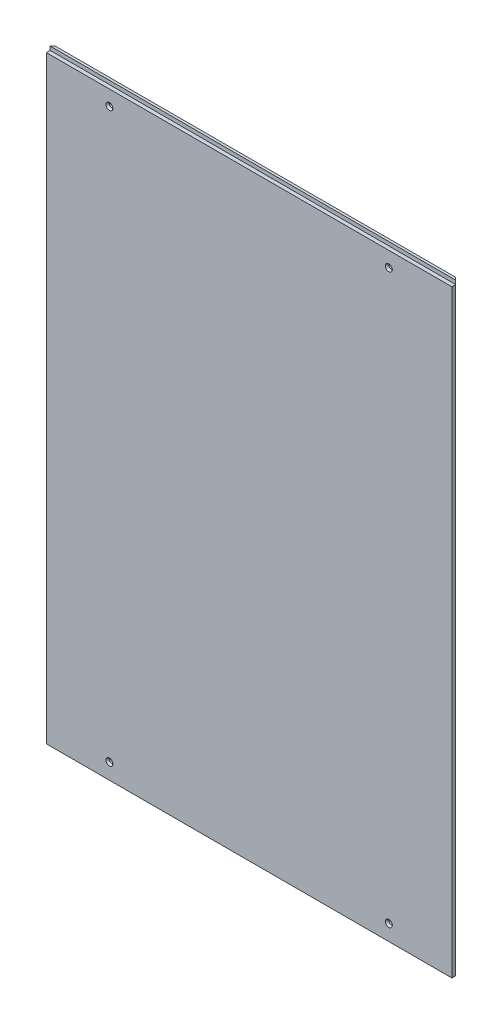
ISO-10303-21;
HEADER;
FILE_DESCRIPTION(('STEP AP214'),'2;1');
FILE_NAME('part.step','',(''),(''),'','','');
FILE_SCHEMA(('AUTOMOTIVE_DESIGN { 1 0 10303 214 1 1 1 1 }'));
ENDSEC;
DATA;
#1=APPLICATION_CONTEXT('core data for automotive mechanical design processes');
#2=APPLICATION_PROTOCOL_DEFINITION('international standard','automotive_design',2000,#1);
#3=PRODUCT_CONTEXT('',#1,'mechanical');
#4=PRODUCT('Part','Part','',(#3));
#5=PRODUCT_RELATED_PRODUCT_CATEGORY('part','',(#4));
#6=PRODUCT_DEFINITION_FORMATION('','',#4);
#7=PRODUCT_DEFINITION_CONTEXT('part definition',#1,'design');
#8=PRODUCT_DEFINITION('design','',#6,#7);
#9=PRODUCT_DEFINITION_SHAPE('','',#8);
#10=(LENGTH_UNIT() NAMED_UNIT(*) SI_UNIT(.MILLI.,.METRE.));
#11=(NAMED_UNIT(*) PLANE_ANGLE_UNIT() SI_UNIT($,.RADIAN.));
#12=(NAMED_UNIT(*) SI_UNIT($,.STERADIAN.) SOLID_ANGLE_UNIT());
#13=UNCERTAINTY_MEASURE_WITH_UNIT(LENGTH_MEASURE(1.E-05),#10,'distance_accuracy_value','');
#14=(GEOMETRIC_REPRESENTATION_CONTEXT(3) GLOBAL_UNCERTAINTY_ASSIGNED_CONTEXT((#13)) GLOBAL_UNIT_ASSIGNED_CONTEXT((#10,
#11,#12)) REPRESENTATION_CONTEXT('',''));
#15=CARTESIAN_POINT('',(0.,0.,0.));
#16=DIRECTION('',(0.,0.,1.));
#17=DIRECTION('',(1.,0.,0.));
#18=AXIS2_PLACEMENT_3D('',#15,#16,#17);
#19=CARTESIAN_POINT('',(321.5,-477.5,10.));
#20=DIRECTION('',(-1.,0.,0.));
#21=DIRECTION('',(0.,0.,1.));
#22=AXIS2_PLACEMENT_3D('',#19,#20,#21);
#23=PLANE('',#22);
#24=DIRECTION('',(0.,0.,-1.));
#25=VECTOR('',#24,1.);
#26=CARTESIAN_POINT('',(321.5,-477.5,10.));
#27=LINE('',#26,#25);
#28=CARTESIAN_POINT('',(321.5,-477.5,10.));
#29=VERTEX_POINT('',#28);
#30=CARTESIAN_POINT('',(321.5,-477.5,4.00000000000001));
#31=VERTEX_POINT('',#30);
#32=EDGE_CURVE('E193',#29,#31,#27,.T.);
#33=ORIENTED_EDGE('',*,*,#32,.T.);
#34=DIRECTION('',(0.,1.,0.));
#35=VECTOR('',#34,1.);
#36=CARTESIAN_POINT('',(321.5,477.5,4.));
#37=LINE('',#36,#35);
#38=CARTESIAN_POINT('',(321.5,471.5,4.));
#39=VERTEX_POINT('',#38);
#40=EDGE_CURVE('E124',#31,#39,#37,.T.);
#41=ORIENTED_EDGE('',*,*,#40,.T.);
#42=DIRECTION('',(0.,0.,1.));
#43=VECTOR('',#42,1.);
#44=CARTESIAN_POINT('',(321.5,471.5,10.));
#45=LINE('',#44,#43);
#46=CARTESIAN_POINT('',(321.5,471.5,10.));
#47=VERTEX_POINT('',#46);
#48=EDGE_CURVE('E109',#39,#47,#45,.T.);
#49=ORIENTED_EDGE('',*,*,#48,.T.);
#50=DIRECTION('',(0.,1.,0.));
#51=VECTOR('',#50,1.);
#52=CARTESIAN_POINT('',(321.5,-477.5,10.));
#53=LINE('',#52,#51);
#54=EDGE_CURVE('E175',#29,#47,#53,.T.);
#55=ORIENTED_EDGE('',*,*,#54,.F.);
#56=EDGE_LOOP('',(#33,#41,#49,#55));
#57=FACE_BOUND('',#56,.T.);
#58=ADVANCED_FACE('F34',(#57),#23,.F.);
#59=CARTESIAN_POINT('',(-321.5,477.5,10.));
#60=DIRECTION('',(0.,-1.,0.));
#61=DIRECTION('',(0.,0.,-1.));
#62=AXIS2_PLACEMENT_3D('',#59,#60,#61);
#63=PLANE('',#62);
#64=DIRECTION('',(-1.,0.,0.));
#65=VECTOR('',#64,1.);
#66=CARTESIAN_POINT('',(321.5,477.5,4.));
#67=LINE('',#66,#65);
#68=CARTESIAN_POINT('',(321.5,477.5,4.));
#69=VERTEX_POINT('',#68);
#70=CARTESIAN_POINT('',(-321.5,477.5,4.));
#71=VERTEX_POINT('',#70);
#72=EDGE_CURVE('E100',#69,#71,#67,.T.);
#73=ORIENTED_EDGE('',*,*,#72,.F.);
#74=DIRECTION('',(-0.707106781186548,0.,-0.707106781186548));
#75=VECTOR('',#74,1.);
#76=CARTESIAN_POINT('',(321.5,477.5,4.));
#77=LINE('',#76,#75);
#78=CARTESIAN_POINT('',(317.5,477.5,0.));
#79=VERTEX_POINT('',#78);
#80=EDGE_CURVE('E115',#69,#79,#77,.T.);
#81=ORIENTED_EDGE('',*,*,#80,.T.);
#82=DIRECTION('',(-1.,0.,0.));
#83=VECTOR('',#82,1.);
#84=CARTESIAN_POINT('',(-321.5,477.5,0.));
#85=LINE('',#84,#83);
#86=CARTESIAN_POINT('',(-317.5,477.5,0.));
#87=VERTEX_POINT('',#86);
#88=EDGE_CURVE('E188',#79,#87,#85,.T.);
#89=ORIENTED_EDGE('',*,*,#88,.T.);
#90=DIRECTION('',(-0.707106781186548,0.,0.707106781186548));
#91=VECTOR('',#90,1.);
#92=CARTESIAN_POINT('',(-321.5,477.5,4.));
#93=LINE('',#92,#91);
#94=EDGE_CURVE('E117',#87,#71,#93,.T.);
#95=ORIENTED_EDGE('',*,*,#94,.T.);
#96=EDGE_LOOP('',(#73,#81,#89,#95));
#97=FACE_BOUND('',#96,.T.);
#98=ADVANCED_FACE('F113',(#97),#63,.F.);
#99=CARTESIAN_POINT('',(-321.5,-477.5,10.));
#100=DIRECTION('',(1.,0.,0.));
#101=DIRECTION('',(0.,0.,-1.));
#102=AXIS2_PLACEMENT_3D('',#99,#100,#101);
#103=PLANE('',#102);
#104=DIRECTION('',(0.,0.,1.));
#105=VECTOR('',#104,1.);
#106=CARTESIAN_POINT('',(-321.5,471.5,10.));
#107=LINE('',#106,#105);
#108=CARTESIAN_POINT('',(-321.5,471.5,4.));
#109=VERTEX_POINT('',#108);
#110=CARTESIAN_POINT('',(-321.5,471.5,10.));
#111=VERTEX_POINT('',#110);
#112=EDGE_CURVE('E110',#109,#111,#107,.T.);
#113=ORIENTED_EDGE('',*,*,#112,.F.);
#114=DIRECTION('',(0.,-1.,0.));
#115=VECTOR('',#114,1.);
#116=CARTESIAN_POINT('',(-321.5,-477.5,4.));
#117=LINE('',#116,#115);
#118=CARTESIAN_POINT('',(-321.5,-477.5,4.00000000000001));
#119=VERTEX_POINT('',#118);
#120=EDGE_CURVE('E49',#109,#119,#117,.T.);
#121=ORIENTED_EDGE('',*,*,#120,.T.);
#122=DIRECTION('',(0.,0.,-1.));
#123=VECTOR('',#122,1.);
#124=CARTESIAN_POINT('',(-321.5,-477.5,10.));
#125=LINE('',#124,#123);
#126=CARTESIAN_POINT('',(-321.5,-477.5,10.));
#127=VERTEX_POINT('',#126);
#128=EDGE_CURVE('E196',#127,#119,#125,.T.);
#129=ORIENTED_EDGE('',*,*,#128,.F.);
#130=DIRECTION('',(0.,-1.,0.));
#131=VECTOR('',#130,1.);
#132=CARTESIAN_POINT('',(-321.5,-477.5,10.));
#133=LINE('',#132,#131);
#134=EDGE_CURVE('E184',#111,#127,#133,.T.);
#135=ORIENTED_EDGE('',*,*,#134,.F.);
#136=EDGE_LOOP('',(#113,#121,#129,#135));
#137=FACE_BOUND('',#136,.T.);
#138=ADVANCED_FACE('F213',(#137),#103,.F.);
#139=CARTESIAN_POINT('',(-321.5,-477.5,10.));
#140=DIRECTION('',(0.,1.,0.));
#141=DIRECTION('',(0.,0.,1.));
#142=AXIS2_PLACEMENT_3D('',#139,#140,#141);
#143=PLANE('',#142);
#144=DIRECTION('',(1.,0.,0.));
#145=VECTOR('',#144,1.);
#146=CARTESIAN_POINT('',(-321.5,-477.5,0.));
#147=LINE('',#146,#145);
#148=CARTESIAN_POINT('',(-317.5,-477.5,0.));
#149=VERTEX_POINT('',#148);
#150=CARTESIAN_POINT('',(317.5,-477.5,0.));
#151=VERTEX_POINT('',#150);
#152=EDGE_CURVE('E185',#149,#151,#147,.T.);
#153=ORIENTED_EDGE('',*,*,#152,.T.);
#154=DIRECTION('',(0.707106781186548,0.,0.707106781186548));
#155=VECTOR('',#154,1.);
#156=CARTESIAN_POINT('',(321.5,-477.5,4.));
#157=LINE('',#156,#155);
#158=EDGE_CURVE('E131',#151,#31,#157,.T.);
#159=ORIENTED_EDGE('',*,*,#158,.T.);
#160=ORIENTED_EDGE('',*,*,#32,.F.);
#161=DIRECTION('',(1.,0.,0.));
#162=VECTOR('',#161,1.);
#163=CARTESIAN_POINT('',(-321.5,-477.5,10.));
#164=LINE('',#163,#162);
#165=EDGE_CURVE('E179',#127,#29,#164,.T.);
#166=ORIENTED_EDGE('',*,*,#165,.F.);
#167=ORIENTED_EDGE('',*,*,#128,.T.);
#168=DIRECTION('',(0.707106781186548,0.,-0.707106781186548));
#169=VECTOR('',#168,1.);
#170=CARTESIAN_POINT('',(-321.5,-477.5,4.));
#171=LINE('',#170,#169);
#172=EDGE_CURVE('E129',#119,#149,#171,.T.);
#173=ORIENTED_EDGE('',*,*,#172,.T.);
#174=EDGE_LOOP('',(#153,#159,#160,#166,#167,#173));
#175=FACE_BOUND('',#174,.T.);
#176=ADVANCED_FACE('F167',(#175),#143,.F.);
#177=CARTESIAN_POINT('',(0.,0.,10.));
#178=DIRECTION('',(0.,0.,-1.));
#179=DIRECTION('',(-1.,0.,0.));
#180=AXIS2_PLACEMENT_3D('',#177,#178,#179);
#181=PLANE('',#180);
#182=CARTESIAN_POINT('',(-221.5,-452.5,10.));
#183=DIRECTION('',(0.,0.,-1.));
#184=DIRECTION('',(-1.,0.,0.));
#185=AXIS2_PLACEMENT_3D('',#182,#183,#184);
#186=CIRCLE('',#185,5.50000000000017);
#187=CARTESIAN_POINT('',(-227.,-452.5,10.));
#188=VERTEX_POINT('',#187);
#189=EDGE_CURVE('E143',#188,#188,#186,.T.);
#190=ORIENTED_EDGE('',*,*,#189,.T.);
#191=EDGE_LOOP('',(#190));
#192=FACE_BOUND('',#191,.T.);
#193=CARTESIAN_POINT('',(221.5,-452.5,10.));
#194=DIRECTION('',(0.,0.,-1.));
#195=DIRECTION('',(-1.,0.,0.));
#196=AXIS2_PLACEMENT_3D('',#193,#194,#195);
#197=CIRCLE('',#196,5.50000000000017);
#198=CARTESIAN_POINT('',(216.,-452.5,10.));
#199=VERTEX_POINT('',#198);
#200=EDGE_CURVE('E140',#199,#199,#197,.T.);
#201=ORIENTED_EDGE('',*,*,#200,.T.);
#202=EDGE_LOOP('',(#201));
#203=FACE_BOUND('',#202,.T.);
#204=CARTESIAN_POINT('',(221.5,447.5,10.));
#205=DIRECTION('',(0.,0.,-1.));
#206=DIRECTION('',(-1.,0.,0.));
#207=AXIS2_PLACEMENT_3D('',#204,#205,#206);
#208=CIRCLE('',#207,5.50000000000017);
#209=CARTESIAN_POINT('',(216.,447.5,10.));
#210=VERTEX_POINT('',#209);
#211=EDGE_CURVE('E137',#210,#210,#208,.T.);
#212=ORIENTED_EDGE('',*,*,#211,.T.);
#213=EDGE_LOOP('',(#212));
#214=FACE_BOUND('',#213,.T.);
#215=CARTESIAN_POINT('',(-221.5,447.5,10.));
#216=DIRECTION('',(0.,0.,-1.));
#217=DIRECTION('',(-1.,0.,0.));
#218=AXIS2_PLACEMENT_3D('',#215,#216,#217);
#219=CIRCLE('',#218,5.50000000000017);
#220=CARTESIAN_POINT('',(-227.,447.5,10.));
#221=VERTEX_POINT('',#220);
#222=EDGE_CURVE('E134',#221,#221,#219,.T.);
#223=ORIENTED_EDGE('',*,*,#222,.T.);
#224=EDGE_LOOP('',(#223));
#225=FACE_BOUND('',#224,.T.);
#226=ORIENTED_EDGE('',*,*,#54,.T.);
#227=DIRECTION('',(-1.,0.,0.));
#228=VECTOR('',#227,1.);
#229=CARTESIAN_POINT('',(321.5,471.5,10.));
#230=LINE('',#229,#228);
#231=EDGE_CURVE('E176',#47,#111,#230,.T.);
#232=ORIENTED_EDGE('',*,*,#231,.T.);
#233=ORIENTED_EDGE('',*,*,#134,.T.);
#234=ORIENTED_EDGE('',*,*,#165,.T.);
#235=EDGE_LOOP('',(#226,#232,#233,#234));
#236=FACE_BOUND('',#235,.T.);
#237=ADVANCED_FACE('F163',(#192,#203,#214,#225,#236),#181,.F.);
#238=CARTESIAN_POINT('',(0.,0.,0.));
#239=DIRECTION('',(0.,0.,-1.));
#240=DIRECTION('',(-1.,0.,0.));
#241=AXIS2_PLACEMENT_3D('',#238,#239,#240);
#242=PLANE('',#241);
#243=CARTESIAN_POINT('',(-241.5,447.5,0.));
#244=DIRECTION('',(0.,0.,-1.));
#245=DIRECTION('',(-1.,0.,0.));
#246=AXIS2_PLACEMENT_3D('',#243,#244,#245);
#247=CIRCLE('',#246,5.99999999999999);
#248=CARTESIAN_POINT('',(-247.5,447.5,0.));
#249=VERTEX_POINT('',#248);
#250=EDGE_CURVE('E309',#249,#249,#247,.T.);
#251=ORIENTED_EDGE('',*,*,#250,.F.);
#252=EDGE_LOOP('',(#251));
#253=FACE_BOUND('',#252,.T.);
#254=CARTESIAN_POINT('',(-201.5,447.5,0.));
#255=DIRECTION('',(0.,0.,-1.));
#256=DIRECTION('',(-1.,0.,0.));
#257=AXIS2_PLACEMENT_3D('',#254,#255,#256);
#258=CIRCLE('',#257,5.99999999999999);
#259=CARTESIAN_POINT('',(-207.5,447.5,0.));
#260=VERTEX_POINT('',#259);
#261=EDGE_CURVE('E308',#260,#260,#258,.T.);
#262=ORIENTED_EDGE('',*,*,#261,.F.);
#263=EDGE_LOOP('',(#262));
#264=FACE_BOUND('',#263,.T.);
#265=CARTESIAN_POINT('',(201.5,447.5,0.));
#266=DIRECTION('',(0.,0.,-1.));
#267=DIRECTION('',(-1.,0.,0.));
#268=AXIS2_PLACEMENT_3D('',#265,#266,#267);
#269=CIRCLE('',#268,5.99999999999999);
#270=CARTESIAN_POINT('',(195.5,447.5,0.));
#271=VERTEX_POINT('',#270);
#272=EDGE_CURVE('E318',#271,#271,#269,.T.);
#273=ORIENTED_EDGE('',*,*,#272,.F.);
#274=EDGE_LOOP('',(#273));
#275=FACE_BOUND('',#274,.T.);
#276=CARTESIAN_POINT('',(241.5,447.5,0.));
#277=DIRECTION('',(0.,0.,-1.));
#278=DIRECTION('',(-1.,0.,0.));
#279=AXIS2_PLACEMENT_3D('',#276,#277,#278);
#280=CIRCLE('',#279,5.99999999999999);
#281=CARTESIAN_POINT('',(235.5,447.5,0.));
#282=VERTEX_POINT('',#281);
#283=EDGE_CURVE('E323',#282,#282,#280,.T.);
#284=ORIENTED_EDGE('',*,*,#283,.F.);
#285=EDGE_LOOP('',(#284));
#286=FACE_BOUND('',#285,.T.);
#287=CARTESIAN_POINT('',(221.5,447.5,0.));
#288=DIRECTION('',(0.,0.,-1.));
#289=DIRECTION('',(-1.,0.,0.));
#290=AXIS2_PLACEMENT_3D('',#287,#288,#289);
#291=CIRCLE('',#290,2.60000000000001);
#292=CARTESIAN_POINT('',(218.9,447.5,0.));
#293=VERTEX_POINT('',#292);
#294=EDGE_CURVE('E329',#293,#293,#291,.T.);
#295=ORIENTED_EDGE('',*,*,#294,.F.);
#296=EDGE_LOOP('',(#295));
#297=FACE_BOUND('',#296,.T.);
#298=CARTESIAN_POINT('',(-221.5,447.5,0.));
#299=DIRECTION('',(0.,0.,-1.));
#300=DIRECTION('',(-1.,0.,0.));
#301=AXIS2_PLACEMENT_3D('',#298,#299,#300);
#302=CIRCLE('',#301,2.60000000000008);
#303=CARTESIAN_POINT('',(-224.1,447.5,0.));
#304=VERTEX_POINT('',#303);
#305=EDGE_CURVE('E334',#304,#304,#302,.T.);
#306=ORIENTED_EDGE('',*,*,#305,.F.);
#307=EDGE_LOOP('',(#306));
#308=FACE_BOUND('',#307,.T.);
#309=CARTESIAN_POINT('',(-221.5,-452.5,0.));
#310=DIRECTION('',(0.,0.,-1.));
#311=DIRECTION('',(-1.,0.,0.));
#312=AXIS2_PLACEMENT_3D('',#309,#310,#311);
#313=CIRCLE('',#312,2.60000000000008);
#314=CARTESIAN_POINT('',(-224.1,-452.5,0.));
#315=VERTEX_POINT('',#314);
#316=EDGE_CURVE('E207',#315,#315,#313,.T.);
#317=ORIENTED_EDGE('',*,*,#316,.F.);
#318=EDGE_LOOP('',(#317));
#319=FACE_BOUND('',#318,.T.);
#320=CARTESIAN_POINT('',(221.5,-452.5,0.));
#321=DIRECTION('',(0.,0.,-1.));
#322=DIRECTION('',(-1.,0.,0.));
#323=AXIS2_PLACEMENT_3D('',#320,#321,#322);
#324=CIRCLE('',#323,2.60000000000001);
#325=CARTESIAN_POINT('',(218.9,-452.5,0.));
#326=VERTEX_POINT('',#325);
#327=EDGE_CURVE('E203',#326,#326,#324,.T.);
#328=ORIENTED_EDGE('',*,*,#327,.F.);
#329=EDGE_LOOP('',(#328));
#330=FACE_BOUND('',#329,.T.);
#331=ORIENTED_EDGE('',*,*,#88,.F.);
#332=DIRECTION('',(0.,-1.,0.));
#333=VECTOR('',#332,1.);
#334=CARTESIAN_POINT('',(317.5,-477.5,0.));
#335=LINE('',#334,#333);
#336=EDGE_CURVE('E57',#79,#151,#335,.T.);
#337=ORIENTED_EDGE('',*,*,#336,.T.);
#338=ORIENTED_EDGE('',*,*,#152,.F.);
#339=DIRECTION('',(0.,1.,0.));
#340=VECTOR('',#339,1.);
#341=CARTESIAN_POINT('',(-317.5,477.5,0.));
#342=LINE('',#341,#340);
#343=EDGE_CURVE('E121',#149,#87,#342,.T.);
#344=ORIENTED_EDGE('',*,*,#343,.T.);
#345=EDGE_LOOP('',(#331,#337,#338,#344));
#346=FACE_BOUND('',#345,.T.);
#347=ADVANCED_FACE('F166',(#253,#264,#275,#286,#297,#308,#319,#330,#346),#242,.T.);
#348=CARTESIAN_POINT('',(321.5,471.5,10.));
#349=DIRECTION('',(0.,-1.,0.));
#350=DIRECTION('',(0.,0.,-1.));
#351=AXIS2_PLACEMENT_3D('',#348,#349,#350);
#352=PLANE('',#351);
#353=ORIENTED_EDGE('',*,*,#112,.T.);
#354=ORIENTED_EDGE('',*,*,#231,.F.);
#355=ORIENTED_EDGE('',*,*,#48,.F.);
#356=DIRECTION('',(-1.,0.,0.));
#357=VECTOR('',#356,1.);
#358=CARTESIAN_POINT('',(321.5,471.5,4.));
#359=LINE('',#358,#357);
#360=EDGE_CURVE('E103',#39,#109,#359,.T.);
#361=ORIENTED_EDGE('',*,*,#360,.T.);
#362=EDGE_LOOP('',(#353,#354,#355,#361));
#363=FACE_BOUND('',#362,.T.);
#364=ADVANCED_FACE('F212',(#363),#352,.F.);
#365=CARTESIAN_POINT('',(321.5,477.5,4.));
#366=DIRECTION('',(0.,0.,-1.));
#367=DIRECTION('',(0.,1.,0.));
#368=AXIS2_PLACEMENT_3D('',#365,#366,#367);
#369=PLANE('',#368);
#370=DIRECTION('',(0.,-1.,0.));
#371=VECTOR('',#370,1.);
#372=CARTESIAN_POINT('',(-321.5,477.5,4.));
#373=LINE('',#372,#371);
#374=EDGE_CURVE('E202',#71,#109,#373,.T.);
#375=ORIENTED_EDGE('',*,*,#374,.T.);
#376=ORIENTED_EDGE('',*,*,#360,.F.);
#377=DIRECTION('',(0.,-1.,0.));
#378=VECTOR('',#377,1.);
#379=CARTESIAN_POINT('',(321.5,477.5,4.));
#380=LINE('',#379,#378);
#381=EDGE_CURVE('E96',#69,#39,#380,.T.);
#382=ORIENTED_EDGE('',*,*,#381,.F.);
#383=ORIENTED_EDGE('',*,*,#72,.T.);
#384=EDGE_LOOP('',(#375,#376,#382,#383));
#385=FACE_BOUND('',#384,.T.);
#386=ADVANCED_FACE('F99',(#385),#369,.F.);
#387=CARTESIAN_POINT('',(321.5,-477.5,4.));
#388=DIRECTION('',(0.707106781186547,0.,-0.707106781186547));
#389=DIRECTION('',(0.,-1.,0.));
#390=AXIS2_PLACEMENT_3D('',#387,#388,#389);
#391=PLANE('',#390);
#392=ORIENTED_EDGE('',*,*,#158,.F.);
#393=ORIENTED_EDGE('',*,*,#336,.F.);
#394=ORIENTED_EDGE('',*,*,#80,.F.);
#395=ORIENTED_EDGE('',*,*,#381,.T.);
#396=ORIENTED_EDGE('',*,*,#40,.F.);
#397=EDGE_LOOP('',(#392,#393,#394,#395,#396));
#398=FACE_BOUND('',#397,.T.);
#399=ADVANCED_FACE('F120',(#398),#391,.T.);
#400=CARTESIAN_POINT('',(-321.5,-477.5,4.));
#401=DIRECTION('',(-0.707106781186547,0.,-0.707106781186547));
#402=DIRECTION('',(0.,1.,0.));
#403=AXIS2_PLACEMENT_3D('',#400,#401,#402);
#404=PLANE('',#403);
#405=ORIENTED_EDGE('',*,*,#94,.F.);
#406=ORIENTED_EDGE('',*,*,#343,.F.);
#407=ORIENTED_EDGE('',*,*,#172,.F.);
#408=ORIENTED_EDGE('',*,*,#120,.F.);
#409=ORIENTED_EDGE('',*,*,#374,.F.);
#410=EDGE_LOOP('',(#405,#406,#407,#408,#409));
#411=FACE_BOUND('',#410,.T.);
#412=ADVANCED_FACE('F201',(#411),#404,.T.);
#413=CARTESIAN_POINT('',(221.5,-452.5,10.));
#414=DIRECTION('',(0.,0.,-1.));
#415=DIRECTION('',(-1.,0.,0.));
#416=AXIS2_PLACEMENT_3D('',#413,#414,#415);
#417=CYLINDRICAL_SURFACE('',#416,2.60000000000001);
#418=CARTESIAN_POINT('',(221.5,-452.5,7.09999999999983));
#419=DIRECTION('',(0.,0.,-1.));
#420=DIRECTION('',(-1.,0.,0.));
#421=AXIS2_PLACEMENT_3D('',#418,#419,#420);
#422=CIRCLE('',#421,2.60000000000001);
#423=CARTESIAN_POINT('',(218.9,-452.5,7.09999999999983));
#424=VERTEX_POINT('',#423);
#425=EDGE_CURVE('E149',#424,#424,#422,.F.);
#426=ORIENTED_EDGE('',*,*,#425,.T.);
#427=EDGE_LOOP('',(#426));
#428=FACE_BOUND('',#427,.T.);
#429=ORIENTED_EDGE('',*,*,#327,.T.);
#430=EDGE_LOOP('',(#429));
#431=FACE_BOUND('',#430,.T.);
#432=ADVANCED_FACE('F231',(#428,#431),#417,.F.);
#433=CARTESIAN_POINT('',(-221.5,-452.5,10.));
#434=DIRECTION('',(0.,0.,-1.));
#435=DIRECTION('',(-1.,0.,0.));
#436=AXIS2_PLACEMENT_3D('',#433,#434,#435);
#437=CYLINDRICAL_SURFACE('',#436,2.60000000000008);
#438=CARTESIAN_POINT('',(-221.5,-452.5,7.0999999999999));
#439=DIRECTION('',(0.,0.,-1.));
#440=DIRECTION('',(-1.,0.,0.));
#441=AXIS2_PLACEMENT_3D('',#438,#439,#440);
#442=CIRCLE('',#441,2.60000000000008);
#443=CARTESIAN_POINT('',(-224.1,-452.5,7.0999999999999));
#444=VERTEX_POINT('',#443);
#445=EDGE_CURVE('E146',#444,#444,#442,.F.);
#446=ORIENTED_EDGE('',*,*,#445,.T.);
#447=EDGE_LOOP('',(#446));
#448=FACE_BOUND('',#447,.T.);
#449=ORIENTED_EDGE('',*,*,#316,.T.);
#450=EDGE_LOOP('',(#449));
#451=FACE_BOUND('',#450,.T.);
#452=ADVANCED_FACE('F247',(#448,#451),#437,.F.);
#453=CARTESIAN_POINT('',(-221.5,447.5,10.));
#454=DIRECTION('',(0.,0.,-1.));
#455=DIRECTION('',(-1.,0.,0.));
#456=AXIS2_PLACEMENT_3D('',#453,#454,#455);
#457=CYLINDRICAL_SURFACE('',#456,2.60000000000008);
#458=CARTESIAN_POINT('',(-221.5,447.5,7.0999999999999));
#459=DIRECTION('',(0.,0.,-1.));
#460=DIRECTION('',(-1.,0.,0.));
#461=AXIS2_PLACEMENT_3D('',#458,#459,#460);
#462=CIRCLE('',#461,2.60000000000008);
#463=CARTESIAN_POINT('',(-224.1,447.5,7.0999999999999));
#464=VERTEX_POINT('',#463);
#465=EDGE_CURVE('E11',#464,#464,#462,.F.);
#466=ORIENTED_EDGE('',*,*,#465,.T.);
#467=EDGE_LOOP('',(#466));
#468=FACE_BOUND('',#467,.T.);
#469=ORIENTED_EDGE('',*,*,#305,.T.);
#470=EDGE_LOOP('',(#469));
#471=FACE_BOUND('',#470,.T.);
#472=ADVANCED_FACE('F265',(#468,#471),#457,.F.);
#473=CARTESIAN_POINT('',(221.5,447.5,10.));
#474=DIRECTION('',(0.,0.,-1.));
#475=DIRECTION('',(-1.,0.,0.));
#476=AXIS2_PLACEMENT_3D('',#473,#474,#475);
#477=CYLINDRICAL_SURFACE('',#476,2.60000000000001);
#478=CARTESIAN_POINT('',(221.5,447.5,7.09999999999983));
#479=DIRECTION('',(0.,0.,-1.));
#480=DIRECTION('',(-1.,0.,0.));
#481=AXIS2_PLACEMENT_3D('',#478,#479,#480);
#482=CIRCLE('',#481,2.60000000000001);
#483=CARTESIAN_POINT('',(218.9,447.5,7.09999999999983));
#484=VERTEX_POINT('',#483);
#485=EDGE_CURVE('E42',#484,#484,#482,.F.);
#486=ORIENTED_EDGE('',*,*,#485,.T.);
#487=EDGE_LOOP('',(#486));
#488=FACE_BOUND('',#487,.T.);
#489=ORIENTED_EDGE('',*,*,#294,.T.);
#490=EDGE_LOOP('',(#489));
#491=FACE_BOUND('',#490,.T.);
#492=ADVANCED_FACE('F154',(#488,#491),#477,.F.);
#493=CARTESIAN_POINT('',(-221.5,-452.5,10.));
#494=DIRECTION('',(0.,0.,1.));
#495=DIRECTION('',(1.,0.,0.));
#496=AXIS2_PLACEMENT_3D('',#493,#494,#495);
#497=CONICAL_SURFACE('',#496,5.50000000000017,0.785398163397447);
#498=ORIENTED_EDGE('',*,*,#445,.F.);
#499=EDGE_LOOP('',(#498));
#500=FACE_BOUND('',#499,.T.);
#501=ORIENTED_EDGE('',*,*,#189,.F.);
#502=EDGE_LOOP('',(#501));
#503=FACE_BOUND('',#502,.T.);
#504=ADVANCED_FACE('F232',(#500,#503),#497,.F.);
#505=CARTESIAN_POINT('',(221.5,-452.5,10.));
#506=DIRECTION('',(0.,0.,1.));
#507=DIRECTION('',(1.,0.,0.));
#508=AXIS2_PLACEMENT_3D('',#505,#506,#507);
#509=CONICAL_SURFACE('',#508,5.50000000000017,0.785398163397447);
#510=ORIENTED_EDGE('',*,*,#425,.F.);
#511=EDGE_LOOP('',(#510));
#512=FACE_BOUND('',#511,.T.);
#513=ORIENTED_EDGE('',*,*,#200,.F.);
#514=EDGE_LOOP('',(#513));
#515=FACE_BOUND('',#514,.T.);
#516=ADVANCED_FACE('F160',(#512,#515),#509,.F.);
#517=CARTESIAN_POINT('',(221.5,447.5,10.));
#518=DIRECTION('',(0.,0.,1.));
#519=DIRECTION('',(1.,0.,0.));
#520=AXIS2_PLACEMENT_3D('',#517,#518,#519);
#521=CONICAL_SURFACE('',#520,5.50000000000017,0.785398163397447);
#522=ORIENTED_EDGE('',*,*,#485,.F.);
#523=EDGE_LOOP('',(#522));
#524=FACE_BOUND('',#523,.T.);
#525=ORIENTED_EDGE('',*,*,#211,.F.);
#526=EDGE_LOOP('',(#525));
#527=FACE_BOUND('',#526,.T.);
#528=ADVANCED_FACE('F157',(#524,#527),#521,.F.);
#529=CARTESIAN_POINT('',(-221.5,447.5,10.));
#530=DIRECTION('',(0.,0.,1.));
#531=DIRECTION('',(1.,0.,0.));
#532=AXIS2_PLACEMENT_3D('',#529,#530,#531);
#533=CONICAL_SURFACE('',#532,5.50000000000017,0.785398163397447);
#534=ORIENTED_EDGE('',*,*,#465,.F.);
#535=EDGE_LOOP('',(#534));
#536=FACE_BOUND('',#535,.T.);
#537=ORIENTED_EDGE('',*,*,#222,.F.);
#538=EDGE_LOOP('',(#537));
#539=FACE_BOUND('',#538,.T.);
#540=ADVANCED_FACE('F36',(#536,#539),#533,.F.);
#541=CARTESIAN_POINT('',(241.5,447.5,4.));
#542=DIRECTION('',(0.,0.,-1.));
#543=DIRECTION('',(-1.,0.,0.));
#544=AXIS2_PLACEMENT_3D('',#541,#542,#543);
#545=CYLINDRICAL_SURFACE('',#544,5.99999999999999);
#546=CARTESIAN_POINT('',(241.5,447.5,4.));
#547=DIRECTION('',(0.,0.,-1.));
#548=DIRECTION('',(-1.,0.,0.));
#549=AXIS2_PLACEMENT_3D('',#546,#547,#548);
#550=CIRCLE('',#549,5.99999999999999);
#551=CARTESIAN_POINT('',(235.5,447.5,4.));
#552=VERTEX_POINT('',#551);
#553=EDGE_CURVE('E326',#552,#552,#550,.T.);
#554=ORIENTED_EDGE('',*,*,#553,.F.);
#555=EDGE_LOOP('',(#554));
#556=FACE_BOUND('',#555,.T.);
#557=ORIENTED_EDGE('',*,*,#283,.T.);
#558=EDGE_LOOP('',(#557));
#559=FACE_BOUND('',#558,.T.);
#560=ADVANCED_FACE('F272',(#556,#559),#545,.F.);
#561=CARTESIAN_POINT('',(241.5,447.5,4.));
#562=DIRECTION('',(0.,0.,-1.));
#563=DIRECTION('',(-1.,0.,0.));
#564=AXIS2_PLACEMENT_3D('',#561,#562,#563);
#565=PLANE('',#564);
#566=ORIENTED_EDGE('',*,*,#553,.T.);
#567=EDGE_LOOP('',(#566));
#568=FACE_BOUND('',#567,.T.);
#569=ADVANCED_FACE('F275',(#568),#565,.T.);
#570=CARTESIAN_POINT('',(201.5,447.5,4.));
#571=DIRECTION('',(0.,0.,-1.));
#572=DIRECTION('',(-1.,0.,0.));
#573=AXIS2_PLACEMENT_3D('',#570,#571,#572);
#574=CYLINDRICAL_SURFACE('',#573,5.99999999999999);
#575=CARTESIAN_POINT('',(201.5,447.5,4.));
#576=DIRECTION('',(0.,0.,-1.));
#577=DIRECTION('',(-1.,0.,0.));
#578=AXIS2_PLACEMENT_3D('',#575,#576,#577);
#579=CIRCLE('',#578,5.99999999999999);
#580=CARTESIAN_POINT('',(195.5,447.5,4.));
#581=VERTEX_POINT('',#580);
#582=EDGE_CURVE('E320',#581,#581,#579,.T.);
#583=ORIENTED_EDGE('',*,*,#582,.F.);
#584=EDGE_LOOP('',(#583));
#585=FACE_BOUND('',#584,.T.);
#586=ORIENTED_EDGE('',*,*,#272,.T.);
#587=EDGE_LOOP('',(#586));
#588=FACE_BOUND('',#587,.T.);
#589=ADVANCED_FACE('F279',(#585,#588),#574,.F.);
#590=CARTESIAN_POINT('',(201.5,447.5,4.));
#591=DIRECTION('',(0.,0.,-1.));
#592=DIRECTION('',(-1.,0.,0.));
#593=AXIS2_PLACEMENT_3D('',#590,#591,#592);
#594=PLANE('',#593);
#595=ORIENTED_EDGE('',*,*,#582,.T.);
#596=EDGE_LOOP('',(#595));
#597=FACE_BOUND('',#596,.T.);
#598=ADVANCED_FACE('F283',(#597),#594,.T.);
#599=CARTESIAN_POINT('',(-201.5,447.5,4.));
#600=DIRECTION('',(0.,0.,-1.));
#601=DIRECTION('',(-1.,0.,0.));
#602=AXIS2_PLACEMENT_3D('',#599,#600,#601);
#603=CYLINDRICAL_SURFACE('',#602,5.99999999999999);
#604=CARTESIAN_POINT('',(-201.5,447.5,4.));
#605=DIRECTION('',(0.,0.,-1.));
#606=DIRECTION('',(-1.,0.,0.));
#607=AXIS2_PLACEMENT_3D('',#604,#605,#606);
#608=CIRCLE('',#607,5.99999999999999);
#609=CARTESIAN_POINT('',(-207.5,447.5,4.));
#610=VERTEX_POINT('',#609);
#611=EDGE_CURVE('E312',#610,#610,#608,.T.);
#612=ORIENTED_EDGE('',*,*,#611,.F.);
#613=EDGE_LOOP('',(#612));
#614=FACE_BOUND('',#613,.T.);
#615=ORIENTED_EDGE('',*,*,#261,.T.);
#616=EDGE_LOOP('',(#615));
#617=FACE_BOUND('',#616,.T.);
#618=ADVANCED_FACE('F287',(#614,#617),#603,.F.);
#619=CARTESIAN_POINT('',(-201.5,447.5,4.));
#620=DIRECTION('',(0.,0.,-1.));
#621=DIRECTION('',(-1.,0.,0.));
#622=AXIS2_PLACEMENT_3D('',#619,#620,#621);
#623=PLANE('',#622);
#624=ORIENTED_EDGE('',*,*,#611,.T.);
#625=EDGE_LOOP('',(#624));
#626=FACE_BOUND('',#625,.T.);
#627=ADVANCED_FACE('F291',(#626),#623,.T.);
#628=CARTESIAN_POINT('',(-241.5,447.5,4.));
#629=DIRECTION('',(0.,0.,-1.));
#630=DIRECTION('',(-1.,0.,0.));
#631=AXIS2_PLACEMENT_3D('',#628,#629,#630);
#632=CYLINDRICAL_SURFACE('',#631,5.99999999999999);
#633=CARTESIAN_POINT('',(-241.5,447.5,4.));
#634=DIRECTION('',(0.,0.,-1.));
#635=DIRECTION('',(-1.,0.,0.));
#636=AXIS2_PLACEMENT_3D('',#633,#634,#635);
#637=CIRCLE('',#636,5.99999999999999);
#638=CARTESIAN_POINT('',(-247.5,447.5,4.));
#639=VERTEX_POINT('',#638);
#640=EDGE_CURVE('E307',#639,#639,#637,.T.);
#641=ORIENTED_EDGE('',*,*,#640,.F.);
#642=EDGE_LOOP('',(#641));
#643=FACE_BOUND('',#642,.T.);
#644=ORIENTED_EDGE('',*,*,#250,.T.);
#645=EDGE_LOOP('',(#644));
#646=FACE_BOUND('',#645,.T.);
#647=ADVANCED_FACE('F295',(#643,#646),#632,.F.);
#648=CARTESIAN_POINT('',(-241.5,447.5,4.));
#649=DIRECTION('',(0.,0.,-1.));
#650=DIRECTION('',(-1.,0.,0.));
#651=AXIS2_PLACEMENT_3D('',#648,#649,#650);
#652=PLANE('',#651);
#653=ORIENTED_EDGE('',*,*,#640,.T.);
#654=EDGE_LOOP('',(#653));
#655=FACE_BOUND('',#654,.T.);
#656=ADVANCED_FACE('F299',(#655),#652,.T.);
#657=CLOSED_SHELL('',(#58,#98,#138,#176,#237,#347,#364,#386,#399,#412,#432,#452,#472,#492,#504,
#516,#528,#540,#560,#569,#589,#598,#618,#627,#647,#656));
#658=MANIFOLD_SOLID_BREP('B2',#657);
#659=ADVANCED_BREP_SHAPE_REPRESENTATION('',(#18,#658),#14);
#660=SHAPE_DEFINITION_REPRESENTATION(#9,#659);
ENDSEC;
END-ISO-10303-21;
